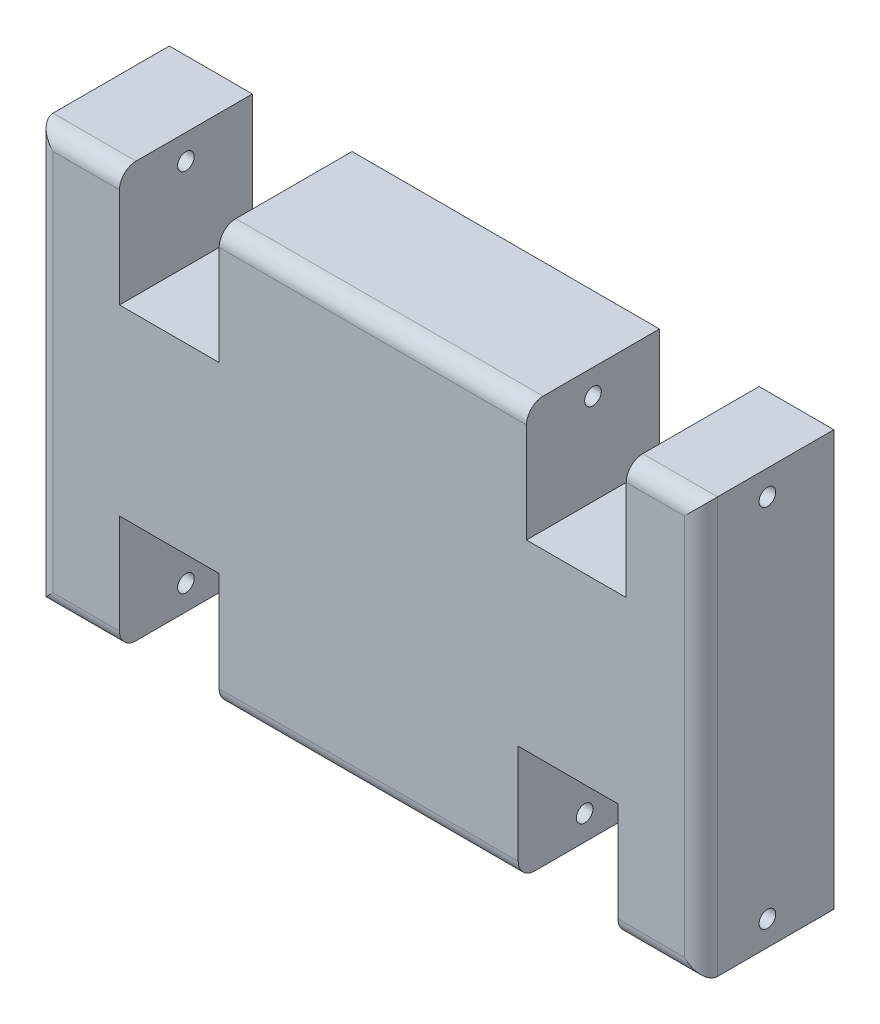
ISO-10303-21;
HEADER;
FILE_DESCRIPTION(('STEP AP214'),'2;1');
FILE_NAME('part.step','',(''),(''),'','','');
FILE_SCHEMA(('AUTOMOTIVE_DESIGN { 1 0 10303 214 1 1 1 1 }'));
ENDSEC;
DATA;
#1=APPLICATION_CONTEXT('core data for automotive mechanical design processes');
#2=APPLICATION_PROTOCOL_DEFINITION('international standard','automotive_design',2000,#1);
#3=PRODUCT_CONTEXT('',#1,'mechanical');
#4=PRODUCT('Part','Part','',(#3));
#5=PRODUCT_RELATED_PRODUCT_CATEGORY('part','',(#4));
#6=PRODUCT_DEFINITION_FORMATION('','',#4);
#7=PRODUCT_DEFINITION_CONTEXT('part definition',#1,'design');
#8=PRODUCT_DEFINITION('design','',#6,#7);
#9=PRODUCT_DEFINITION_SHAPE('','',#8);
#10=(LENGTH_UNIT() NAMED_UNIT(*) SI_UNIT(.MILLI.,.METRE.));
#11=(NAMED_UNIT(*) PLANE_ANGLE_UNIT() SI_UNIT($,.RADIAN.));
#12=(NAMED_UNIT(*) SI_UNIT($,.STERADIAN.) SOLID_ANGLE_UNIT());
#13=UNCERTAINTY_MEASURE_WITH_UNIT(LENGTH_MEASURE(1.E-05),#10,'distance_accuracy_value','');
#14=(GEOMETRIC_REPRESENTATION_CONTEXT(3) GLOBAL_UNCERTAINTY_ASSIGNED_CONTEXT((#13)) GLOBAL_UNIT_ASSIGNED_CONTEXT((#10,
#11,#12)) REPRESENTATION_CONTEXT('',''));
#15=CARTESIAN_POINT('',(0.,0.,0.));
#16=DIRECTION('',(0.,0.,1.));
#17=DIRECTION('',(1.,0.,0.));
#18=AXIS2_PLACEMENT_3D('',#15,#16,#17);
#19=CARTESIAN_POINT('',(1.,0.,7.));
#20=DIRECTION('',(0.,1.,0.));
#21=DIRECTION('',(-1.,0.,0.));
#22=AXIS2_PLACEMENT_3D('',#19,#20,#21);
#23=CYLINDRICAL_SURFACE('',#22,1.);
#24=CARTESIAN_POINT('',(1.,1.,7.));
#25=DIRECTION('',(-0.707106781186547,0.707106781186547,0.));
#26=DIRECTION('',(-0.707106781186547,-0.707106781186547,0.));
#27=AXIS2_PLACEMENT_3D('',#24,#25,#26);
#28=ELLIPSE('',#27,1.41421356237309,1.);
#29=CARTESIAN_POINT('',(1.,1.,8.));
#30=VERTEX_POINT('',#29);
#31=CARTESIAN_POINT('',(0.,0.,7.));
#32=VERTEX_POINT('',#31);
#33=EDGE_CURVE('E11',#30,#32,#28,.F.);
#34=ORIENTED_EDGE('',*,*,#33,.F.);
#35=DIRECTION('',(0.,-1.,0.));
#36=VECTOR('',#35,1.);
#37=CARTESIAN_POINT('',(1.,0.,8.));
#38=LINE('',#37,#36);
#39=CARTESIAN_POINT('',(0.999999999999999,24.,8.));
#40=VERTEX_POINT('',#39);
#41=EDGE_CURVE('E480',#40,#30,#38,.T.);
#42=ORIENTED_EDGE('',*,*,#41,.F.);
#43=CARTESIAN_POINT('',(0.999999999999999,24.,7.));
#44=DIRECTION('',(0.707106781186547,0.707106781186547,0.));
#45=DIRECTION('',(-0.707106781186547,0.707106781186547,0.));
#46=AXIS2_PLACEMENT_3D('',#43,#44,#45);
#47=ELLIPSE('',#46,1.41421356237309,1.);
#48=CARTESIAN_POINT('',(0.,25.,7.));
#49=VERTEX_POINT('',#48);
#50=EDGE_CURVE('E48',#40,#49,#47,.F.);
#51=ORIENTED_EDGE('',*,*,#50,.T.);
#52=DIRECTION('',(0.,-1.,0.));
#53=VECTOR('',#52,1.);
#54=CARTESIAN_POINT('',(0.,0.,7.));
#55=LINE('',#54,#53);
#56=EDGE_CURVE('E494',#32,#49,#55,.F.);
#57=ORIENTED_EDGE('',*,*,#56,.F.);
#58=EDGE_LOOP('',(#34,#42,#51,#57));
#59=FACE_BOUND('',#58,.T.);
#60=ADVANCED_FACE('F39',(#59),#23,.T.);
#61=CARTESIAN_POINT('',(0.,24.,7.));
#62=DIRECTION('',(1.,0.,0.));
#63=DIRECTION('',(0.,0.,-1.));
#64=AXIS2_PLACEMENT_3D('',#61,#62,#63);
#65=CYLINDRICAL_SURFACE('',#64,1.);
#66=ORIENTED_EDGE('',*,*,#50,.F.);
#67=DIRECTION('',(-1.,0.,0.));
#68=VECTOR('',#67,1.);
#69=CARTESIAN_POINT('',(0.,24.,8.));
#70=LINE('',#69,#68);
#71=CARTESIAN_POINT('',(5.,24.,8.));
#72=VERTEX_POINT('',#71);
#73=EDGE_CURVE('E483',#72,#40,#70,.T.);
#74=ORIENTED_EDGE('',*,*,#73,.F.);
#75=CARTESIAN_POINT('',(5.,24.,7.));
#76=DIRECTION('',(-1.,0.,0.));
#77=DIRECTION('',(0.,0.,1.));
#78=AXIS2_PLACEMENT_3D('',#75,#76,#77);
#79=CIRCLE('',#78,1.);
#80=CARTESIAN_POINT('',(5.,25.,7.));
#81=VERTEX_POINT('',#80);
#82=EDGE_CURVE('E491',#81,#72,#79,.F.);
#83=ORIENTED_EDGE('',*,*,#82,.F.);
#84=DIRECTION('',(-1.,0.,0.));
#85=VECTOR('',#84,1.);
#86=CARTESIAN_POINT('',(0.,25.,7.));
#87=LINE('',#86,#85);
#88=EDGE_CURVE('E487',#49,#81,#87,.F.);
#89=ORIENTED_EDGE('',*,*,#88,.F.);
#90=EDGE_LOOP('',(#66,#74,#83,#89));
#91=FACE_BOUND('',#90,.T.);
#92=ADVANCED_FACE('F514',(#91),#65,.T.);
#93=CARTESIAN_POINT('',(0.,1.,7.));
#94=DIRECTION('',(-1.,0.,0.));
#95=DIRECTION('',(0.,0.,1.));
#96=AXIS2_PLACEMENT_3D('',#93,#94,#95);
#97=CYLINDRICAL_SURFACE('',#96,1.);
#98=DIRECTION('',(1.,0.,0.));
#99=VECTOR('',#98,1.);
#100=CARTESIAN_POINT('',(0.,1.,8.));
#101=LINE('',#100,#99);
#102=CARTESIAN_POINT('',(5.,1.,8.));
#103=VERTEX_POINT('',#102);
#104=EDGE_CURVE('E219',#30,#103,#101,.T.);
#105=ORIENTED_EDGE('',*,*,#104,.F.);
#106=ORIENTED_EDGE('',*,*,#33,.T.);
#107=DIRECTION('',(1.,0.,0.));
#108=VECTOR('',#107,1.);
#109=CARTESIAN_POINT('',(0.,0.,7.));
#110=LINE('',#109,#108);
#111=CARTESIAN_POINT('',(5.,0.,7.));
#112=VERTEX_POINT('',#111);
#113=EDGE_CURVE('E498',#112,#32,#110,.F.);
#114=ORIENTED_EDGE('',*,*,#113,.F.);
#115=CARTESIAN_POINT('',(5.,1.,7.));
#116=DIRECTION('',(-1.,0.,0.));
#117=DIRECTION('',(0.,0.,1.));
#118=AXIS2_PLACEMENT_3D('',#115,#116,#117);
#119=CIRCLE('',#118,1.);
#120=EDGE_CURVE('E55',#103,#112,#119,.F.);
#121=ORIENTED_EDGE('',*,*,#120,.F.);
#122=EDGE_LOOP('',(#105,#106,#114,#121));
#123=FACE_BOUND('',#122,.T.);
#124=ADVANCED_FACE('F41',(#123),#97,.T.);
#125=CARTESIAN_POINT('',(0.,24.,7.));
#126=DIRECTION('',(1.,0.,0.));
#127=DIRECTION('',(0.,0.,-1.));
#128=AXIS2_PLACEMENT_3D('',#125,#126,#127);
#129=CYLINDRICAL_SURFACE('',#128,1.);
#130=DIRECTION('',(-1.,0.,0.));
#131=VECTOR('',#130,1.);
#132=CARTESIAN_POINT('',(0.,24.,8.));
#133=LINE('',#132,#131);
#134=CARTESIAN_POINT('',(29.5,24.,8.));
#135=VERTEX_POINT('',#134);
#136=CARTESIAN_POINT('',(11.,24.,8.));
#137=VERTEX_POINT('',#136);
#138=EDGE_CURVE('E463',#135,#137,#133,.T.);
#139=ORIENTED_EDGE('',*,*,#138,.F.);
#140=CARTESIAN_POINT('',(29.5,24.,7.));
#141=DIRECTION('',(-1.,0.,0.));
#142=DIRECTION('',(0.,0.,1.));
#143=AXIS2_PLACEMENT_3D('',#140,#141,#142);
#144=CIRCLE('',#143,1.);
#145=CARTESIAN_POINT('',(29.5,25.,7.));
#146=VERTEX_POINT('',#145);
#147=EDGE_CURVE('E475',#146,#135,#144,.F.);
#148=ORIENTED_EDGE('',*,*,#147,.F.);
#149=DIRECTION('',(-1.,0.,0.));
#150=VECTOR('',#149,1.);
#151=CARTESIAN_POINT('',(0.,25.,7.));
#152=LINE('',#151,#150);
#153=CARTESIAN_POINT('',(11.,25.,7.));
#154=VERTEX_POINT('',#153);
#155=EDGE_CURVE('E471',#154,#146,#152,.F.);
#156=ORIENTED_EDGE('',*,*,#155,.F.);
#157=CARTESIAN_POINT('',(11.,24.,7.));
#158=DIRECTION('',(1.,0.,0.));
#159=DIRECTION('',(0.,0.,-1.));
#160=AXIS2_PLACEMENT_3D('',#157,#158,#159);
#161=CIRCLE('',#160,1.);
#162=EDGE_CURVE('E467',#137,#154,#161,.F.);
#163=ORIENTED_EDGE('',*,*,#162,.F.);
#164=EDGE_LOOP('',(#139,#148,#156,#163));
#165=FACE_BOUND('',#164,.T.);
#166=ADVANCED_FACE('F528',(#165),#129,.T.);
#167=CARTESIAN_POINT('',(39.,0.,7.));
#168=DIRECTION('',(0.,-1.,0.));
#169=DIRECTION('',(1.,0.,0.));
#170=AXIS2_PLACEMENT_3D('',#167,#168,#169);
#171=CYLINDRICAL_SURFACE('',#170,1.);
#172=CARTESIAN_POINT('',(39.,24.,7.));
#173=DIRECTION('',(0.707106781186548,-0.707106781186547,0.));
#174=DIRECTION('',(0.707106781186547,0.707106781186548,0.));
#175=AXIS2_PLACEMENT_3D('',#172,#173,#174);
#176=ELLIPSE('',#175,1.41421356237309,1.);
#177=CARTESIAN_POINT('',(39.,24.,8.));
#178=VERTEX_POINT('',#177);
#179=CARTESIAN_POINT('',(40.,25.,7.));
#180=VERTEX_POINT('',#179);
#181=EDGE_CURVE('E460',#178,#180,#176,.F.);
#182=ORIENTED_EDGE('',*,*,#181,.F.);
#183=DIRECTION('',(0.,1.,0.));
#184=VECTOR('',#183,1.);
#185=CARTESIAN_POINT('',(39.,0.,8.));
#186=LINE('',#185,#184);
#187=CARTESIAN_POINT('',(39.,1.,8.));
#188=VERTEX_POINT('',#187);
#189=EDGE_CURVE('E430',#188,#178,#186,.T.);
#190=ORIENTED_EDGE('',*,*,#189,.F.);
#191=CARTESIAN_POINT('',(39.,1.,7.));
#192=DIRECTION('',(-0.707106781186547,-0.707106781186548,0.));
#193=DIRECTION('',(0.707106781186548,-0.707106781186547,0.));
#194=AXIS2_PLACEMENT_3D('',#191,#192,#193);
#195=ELLIPSE('',#194,1.4142135623731,1.);
#196=CARTESIAN_POINT('',(40.,0.,7.));
#197=VERTEX_POINT('',#196);
#198=EDGE_CURVE('E457',#188,#197,#195,.F.);
#199=ORIENTED_EDGE('',*,*,#198,.T.);
#200=DIRECTION('',(0.,1.,0.));
#201=VECTOR('',#200,1.);
#202=CARTESIAN_POINT('',(40.,0.,7.));
#203=LINE('',#202,#201);
#204=EDGE_CURVE('E445',#180,#197,#203,.F.);
#205=ORIENTED_EDGE('',*,*,#204,.F.);
#206=EDGE_LOOP('',(#182,#190,#199,#205));
#207=FACE_BOUND('',#206,.T.);
#208=ADVANCED_FACE('F533',(#207),#171,.T.);
#209=CARTESIAN_POINT('',(0.,1.,7.));
#210=DIRECTION('',(-1.,0.,0.));
#211=DIRECTION('',(0.,0.,1.));
#212=AXIS2_PLACEMENT_3D('',#209,#210,#211);
#213=CYLINDRICAL_SURFACE('',#212,1.);
#214=ORIENTED_EDGE('',*,*,#198,.F.);
#215=DIRECTION('',(1.,0.,0.));
#216=VECTOR('',#215,1.);
#217=CARTESIAN_POINT('',(0.,1.,8.));
#218=LINE('',#217,#216);
#219=CARTESIAN_POINT('',(35.,1.,8.));
#220=VERTEX_POINT('',#219);
#221=EDGE_CURVE('E434',#220,#188,#218,.T.);
#222=ORIENTED_EDGE('',*,*,#221,.F.);
#223=CARTESIAN_POINT('',(35.,1.,7.));
#224=DIRECTION('',(1.,0.,0.));
#225=DIRECTION('',(0.,0.,-1.));
#226=AXIS2_PLACEMENT_3D('',#223,#224,#225);
#227=CIRCLE('',#226,1.);
#228=CARTESIAN_POINT('',(35.,0.,7.));
#229=VERTEX_POINT('',#228);
#230=EDGE_CURVE('E442',#229,#220,#227,.F.);
#231=ORIENTED_EDGE('',*,*,#230,.F.);
#232=DIRECTION('',(1.,0.,0.));
#233=VECTOR('',#232,1.);
#234=CARTESIAN_POINT('',(0.,0.,7.));
#235=LINE('',#234,#233);
#236=EDGE_CURVE('E438',#197,#229,#235,.F.);
#237=ORIENTED_EDGE('',*,*,#236,.F.);
#238=EDGE_LOOP('',(#214,#222,#231,#237));
#239=FACE_BOUND('',#238,.T.);
#240=ADVANCED_FACE('F545',(#239),#213,.T.);
#241=CARTESIAN_POINT('',(0.,24.,7.));
#242=DIRECTION('',(1.,0.,0.));
#243=DIRECTION('',(0.,0.,-1.));
#244=AXIS2_PLACEMENT_3D('',#241,#242,#243);
#245=CYLINDRICAL_SURFACE('',#244,1.);
#246=DIRECTION('',(-1.,0.,0.));
#247=VECTOR('',#246,1.);
#248=CARTESIAN_POINT('',(0.,24.,8.));
#249=LINE('',#248,#247);
#250=CARTESIAN_POINT('',(35.5,24.,8.));
#251=VERTEX_POINT('',#250);
#252=EDGE_CURVE('E426',#178,#251,#249,.T.);
#253=ORIENTED_EDGE('',*,*,#252,.F.);
#254=ORIENTED_EDGE('',*,*,#181,.T.);
#255=DIRECTION('',(-1.,0.,0.));
#256=VECTOR('',#255,1.);
#257=CARTESIAN_POINT('',(0.,25.,7.));
#258=LINE('',#257,#256);
#259=CARTESIAN_POINT('',(35.5,25.,7.));
#260=VERTEX_POINT('',#259);
#261=EDGE_CURVE('E453',#260,#180,#258,.F.);
#262=ORIENTED_EDGE('',*,*,#261,.F.);
#263=CARTESIAN_POINT('',(35.5,24.,7.));
#264=DIRECTION('',(1.,0.,0.));
#265=DIRECTION('',(0.,0.,-1.));
#266=AXIS2_PLACEMENT_3D('',#263,#264,#265);
#267=CIRCLE('',#266,1.);
#268=EDGE_CURVE('E449',#251,#260,#267,.F.);
#269=ORIENTED_EDGE('',*,*,#268,.F.);
#270=EDGE_LOOP('',(#253,#254,#262,#269));
#271=FACE_BOUND('',#270,.T.);
#272=ADVANCED_FACE('F541',(#271),#245,.T.);
#273=CARTESIAN_POINT('',(0.,1.,7.));
#274=DIRECTION('',(-1.,0.,0.));
#275=DIRECTION('',(0.,0.,1.));
#276=AXIS2_PLACEMENT_3D('',#273,#274,#275);
#277=CYLINDRICAL_SURFACE('',#276,1.);
#278=DIRECTION('',(1.,0.,0.));
#279=VECTOR('',#278,1.);
#280=CARTESIAN_POINT('',(0.,1.,8.));
#281=LINE('',#280,#279);
#282=CARTESIAN_POINT('',(11.,1.,8.));
#283=VERTEX_POINT('',#282);
#284=CARTESIAN_POINT('',(29.,1.,8.));
#285=VERTEX_POINT('',#284);
#286=EDGE_CURVE('E405',#283,#285,#281,.T.);
#287=ORIENTED_EDGE('',*,*,#286,.F.);
#288=CARTESIAN_POINT('',(11.,1.,7.));
#289=DIRECTION('',(1.,0.,0.));
#290=DIRECTION('',(0.,0.,-1.));
#291=AXIS2_PLACEMENT_3D('',#288,#289,#290);
#292=CIRCLE('',#291,1.);
#293=CARTESIAN_POINT('',(11.,0.,7.));
#294=VERTEX_POINT('',#293);
#295=EDGE_CURVE('E423',#294,#283,#292,.F.);
#296=ORIENTED_EDGE('',*,*,#295,.F.);
#297=DIRECTION('',(1.,0.,0.));
#298=VECTOR('',#297,1.);
#299=CARTESIAN_POINT('',(0.,0.,7.));
#300=LINE('',#299,#298);
#301=CARTESIAN_POINT('',(29.,0.,7.));
#302=VERTEX_POINT('',#301);
#303=EDGE_CURVE('E419',#302,#294,#300,.F.);
#304=ORIENTED_EDGE('',*,*,#303,.F.);
#305=CARTESIAN_POINT('',(29.,1.,7.));
#306=DIRECTION('',(-1.,0.,0.));
#307=DIRECTION('',(0.,0.,1.));
#308=AXIS2_PLACEMENT_3D('',#305,#306,#307);
#309=CIRCLE('',#308,1.);
#310=EDGE_CURVE('E415',#285,#302,#309,.F.);
#311=ORIENTED_EDGE('',*,*,#310,.F.);
#312=EDGE_LOOP('',(#287,#296,#304,#311));
#313=FACE_BOUND('',#312,.T.);
#314=ADVANCED_FACE('F544',(#313),#277,.T.);
#315=CARTESIAN_POINT('',(0.,25.,8.));
#316=DIRECTION('',(1.,0.,0.));
#317=DIRECTION('',(0.,1.,0.));
#318=AXIS2_PLACEMENT_3D('',#315,#316,#317);
#319=PLANE('',#318);
#320=CARTESIAN_POINT('',(0.,23.4982475986084,4.));
#321=DIRECTION('',(1.,0.,0.));
#322=DIRECTION('',(0.,1.,0.));
#323=AXIS2_PLACEMENT_3D('',#320,#321,#322);
#324=CIRCLE('',#323,0.5);
#325=CARTESIAN_POINT('',(0.,23.9982475986084,4.));
#326=VERTEX_POINT('',#325);
#327=EDGE_CURVE('E663',#326,#326,#324,.T.);
#328=ORIENTED_EDGE('',*,*,#327,.T.);
#329=EDGE_LOOP('',(#328));
#330=FACE_BOUND('',#329,.T.);
#331=DIRECTION('',(0.,0.,-1.));
#332=VECTOR('',#331,1.);
#333=CARTESIAN_POINT('',(0.,0.,8.));
#334=LINE('',#333,#332);
#335=CARTESIAN_POINT('',(0.,0.,0.));
#336=VERTEX_POINT('',#335);
#337=EDGE_CURVE('E402',#32,#336,#334,.T.);
#338=ORIENTED_EDGE('',*,*,#337,.F.);
#339=ORIENTED_EDGE('',*,*,#56,.T.);
#340=DIRECTION('',(0.,0.,-1.));
#341=VECTOR('',#340,1.);
#342=CARTESIAN_POINT('',(0.,25.,8.));
#343=LINE('',#342,#341);
#344=CARTESIAN_POINT('',(0.,25.,0.));
#345=VERTEX_POINT('',#344);
#346=EDGE_CURVE('E273',#49,#345,#343,.T.);
#347=ORIENTED_EDGE('',*,*,#346,.T.);
#348=DIRECTION('',(0.,-1.,0.));
#349=VECTOR('',#348,1.);
#350=CARTESIAN_POINT('',(0.,25.,0.));
#351=LINE('',#350,#349);
#352=EDGE_CURVE('E274',#345,#336,#351,.T.);
#353=ORIENTED_EDGE('',*,*,#352,.T.);
#354=EDGE_LOOP('',(#338,#339,#347,#353));
#355=FACE_BOUND('',#354,.T.);
#356=CARTESIAN_POINT('',(0.,1.50175240139162,4.));
#357=DIRECTION('',(1.,0.,0.));
#358=DIRECTION('',(0.,1.,0.));
#359=AXIS2_PLACEMENT_3D('',#356,#357,#358);
#360=CIRCLE('',#359,0.5);
#361=CARTESIAN_POINT('',(0.,2.00175240139162,4.));
#362=VERTEX_POINT('',#361);
#363=EDGE_CURVE('E279',#362,#362,#360,.F.);
#364=ORIENTED_EDGE('',*,*,#363,.F.);
#365=EDGE_LOOP('',(#364));
#366=FACE_BOUND('',#365,.T.);
#367=ADVANCED_FACE('F511',(#330,#355,#366),#319,.F.);
#368=CARTESIAN_POINT('',(40.,25.,8.));
#369=DIRECTION('',(-1.,0.,0.));
#370=DIRECTION('',(0.,-1.,0.));
#371=AXIS2_PLACEMENT_3D('',#368,#369,#370);
#372=PLANE('',#371);
#373=CARTESIAN_POINT('',(40.,23.4982475986084,4.));
#374=DIRECTION('',(1.,0.,0.));
#375=DIRECTION('',(0.,0.,-1.));
#376=AXIS2_PLACEMENT_3D('',#373,#374,#375);
#377=CIRCLE('',#376,0.5);
#378=CARTESIAN_POINT('',(40.,23.4982475986084,3.5));
#379=VERTEX_POINT('',#378);
#380=EDGE_CURVE('E740',#379,#379,#377,.T.);
#381=ORIENTED_EDGE('',*,*,#380,.F.);
#382=EDGE_LOOP('',(#381));
#383=FACE_BOUND('',#382,.T.);
#384=DIRECTION('',(0.,0.,-1.));
#385=VECTOR('',#384,1.);
#386=CARTESIAN_POINT('',(40.,25.,8.));
#387=LINE('',#386,#385);
#388=CARTESIAN_POINT('',(40.,25.,0.));
#389=VERTEX_POINT('',#388);
#390=EDGE_CURVE('E375',#180,#389,#387,.T.);
#391=ORIENTED_EDGE('',*,*,#390,.F.);
#392=ORIENTED_EDGE('',*,*,#204,.T.);
#393=DIRECTION('',(0.,0.,-1.));
#394=VECTOR('',#393,1.);
#395=CARTESIAN_POINT('',(40.,0.,8.));
#396=LINE('',#395,#394);
#397=CARTESIAN_POINT('',(40.,0.,0.));
#398=VERTEX_POINT('',#397);
#399=EDGE_CURVE('E378',#197,#398,#396,.T.);
#400=ORIENTED_EDGE('',*,*,#399,.T.);
#401=DIRECTION('',(0.,1.,0.));
#402=VECTOR('',#401,1.);
#403=CARTESIAN_POINT('',(40.,25.,0.));
#404=LINE('',#403,#402);
#405=EDGE_CURVE('E310',#398,#389,#404,.T.);
#406=ORIENTED_EDGE('',*,*,#405,.T.);
#407=EDGE_LOOP('',(#391,#392,#400,#406));
#408=FACE_BOUND('',#407,.T.);
#409=CARTESIAN_POINT('',(40.,1.50175240139162,4.));
#410=DIRECTION('',(-1.,0.,0.));
#411=DIRECTION('',(0.,0.,1.));
#412=AXIS2_PLACEMENT_3D('',#409,#410,#411);
#413=CIRCLE('',#412,0.5);
#414=CARTESIAN_POINT('',(40.,1.50175240139162,4.5));
#415=VERTEX_POINT('',#414);
#416=EDGE_CURVE('E411',#415,#415,#413,.T.);
#417=ORIENTED_EDGE('',*,*,#416,.T.);
#418=EDGE_LOOP('',(#417));
#419=FACE_BOUND('',#418,.T.);
#420=ADVANCED_FACE('F558',(#383,#408,#419),#372,.F.);
#421=CARTESIAN_POINT('',(0.,0.,8.));
#422=DIRECTION('',(0.,1.,0.));
#423=DIRECTION('',(0.,0.,1.));
#424=AXIS2_PLACEMENT_3D('',#421,#422,#423);
#425=PLANE('',#424);
#426=DIRECTION('',(0.,0.,-1.));
#427=VECTOR('',#426,1.);
#428=CARTESIAN_POINT('',(5.,0.,8.));
#429=LINE('',#428,#427);
#430=CARTESIAN_POINT('',(5.,0.,0.));
#431=VERTEX_POINT('',#430);
#432=EDGE_CURVE('E231',#112,#431,#429,.T.);
#433=ORIENTED_EDGE('',*,*,#432,.F.);
#434=ORIENTED_EDGE('',*,*,#113,.T.);
#435=ORIENTED_EDGE('',*,*,#337,.T.);
#436=DIRECTION('',(1.,0.,0.));
#437=VECTOR('',#436,1.);
#438=CARTESIAN_POINT('',(0.,0.,0.));
#439=LINE('',#438,#437);
#440=EDGE_CURVE('E278',#336,#431,#439,.T.);
#441=ORIENTED_EDGE('',*,*,#440,.T.);
#442=EDGE_LOOP('',(#433,#434,#435,#441));
#443=FACE_BOUND('',#442,.T.);
#444=ADVANCED_FACE('F526',(#443),#425,.F.);
#445=CARTESIAN_POINT('',(5.,0.,8.));
#446=DIRECTION('',(-1.,0.,0.));
#447=DIRECTION('',(0.,0.,1.));
#448=AXIS2_PLACEMENT_3D('',#445,#446,#447);
#449=PLANE('',#448);
#450=CARTESIAN_POINT('',(5.,1.50175240139162,4.));
#451=DIRECTION('',(-1.,0.,0.));
#452=DIRECTION('',(0.,0.,1.));
#453=AXIS2_PLACEMENT_3D('',#450,#451,#452);
#454=CIRCLE('',#453,0.5);
#455=CARTESIAN_POINT('',(5.,1.50175240139162,4.5));
#456=VERTEX_POINT('',#455);
#457=EDGE_CURVE('E678',#456,#456,#454,.F.);
#458=ORIENTED_EDGE('',*,*,#457,.F.);
#459=EDGE_LOOP('',(#458));
#460=FACE_BOUND('',#459,.T.);
#461=DIRECTION('',(0.,1.,0.));
#462=VECTOR('',#461,1.);
#463=CARTESIAN_POINT('',(5.,0.,8.));
#464=LINE('',#463,#462);
#465=CARTESIAN_POINT('',(5.,7.,8.));
#466=VERTEX_POINT('',#465);
#467=EDGE_CURVE('E210',#103,#466,#464,.T.);
#468=ORIENTED_EDGE('',*,*,#467,.F.);
#469=ORIENTED_EDGE('',*,*,#120,.T.);
#470=ORIENTED_EDGE('',*,*,#432,.T.);
#471=DIRECTION('',(0.,1.,0.));
#472=VECTOR('',#471,1.);
#473=CARTESIAN_POINT('',(5.,0.,0.));
#474=LINE('',#473,#472);
#475=CARTESIAN_POINT('',(5.,7.,0.));
#476=VERTEX_POINT('',#475);
#477=EDGE_CURVE('E227',#431,#476,#474,.T.);
#478=ORIENTED_EDGE('',*,*,#477,.T.);
#479=DIRECTION('',(0.,0.,-1.));
#480=VECTOR('',#479,1.);
#481=CARTESIAN_POINT('',(5.,7.,8.));
#482=LINE('',#481,#480);
#483=EDGE_CURVE('E224',#466,#476,#482,.T.);
#484=ORIENTED_EDGE('',*,*,#483,.F.);
#485=EDGE_LOOP('',(#468,#469,#470,#478,#484));
#486=FACE_BOUND('',#485,.T.);
#487=ADVANCED_FACE('F225',(#460,#486),#449,.F.);
#488=CARTESIAN_POINT('',(5.,7.,8.));
#489=DIRECTION('',(0.,1.,0.));
#490=DIRECTION('',(0.,0.,1.));
#491=AXIS2_PLACEMENT_3D('',#488,#489,#490);
#492=PLANE('',#491);
#493=DIRECTION('',(1.,0.,0.));
#494=VECTOR('',#493,1.);
#495=CARTESIAN_POINT('',(5.,7.,0.));
#496=LINE('',#495,#494);
#497=CARTESIAN_POINT('',(11.,7.,0.));
#498=VERTEX_POINT('',#497);
#499=EDGE_CURVE('E285',#476,#498,#496,.T.);
#500=ORIENTED_EDGE('',*,*,#499,.T.);
#501=DIRECTION('',(0.,0.,-1.));
#502=VECTOR('',#501,1.);
#503=CARTESIAN_POINT('',(11.,7.,8.));
#504=LINE('',#503,#502);
#505=CARTESIAN_POINT('',(11.,7.,8.));
#506=VERTEX_POINT('',#505);
#507=EDGE_CURVE('E232',#506,#498,#504,.T.);
#508=ORIENTED_EDGE('',*,*,#507,.F.);
#509=DIRECTION('',(1.,0.,0.));
#510=VECTOR('',#509,1.);
#511=CARTESIAN_POINT('',(5.,7.,8.));
#512=LINE('',#511,#510);
#513=EDGE_CURVE('E216',#466,#506,#512,.T.);
#514=ORIENTED_EDGE('',*,*,#513,.F.);
#515=ORIENTED_EDGE('',*,*,#483,.T.);
#516=EDGE_LOOP('',(#500,#508,#514,#515));
#517=FACE_BOUND('',#516,.T.);
#518=ADVANCED_FACE('F234',(#517),#492,.F.);
#519=CARTESIAN_POINT('',(11.,7.,8.));
#520=DIRECTION('',(1.,0.,0.));
#521=DIRECTION('',(0.,0.,-1.));
#522=AXIS2_PLACEMENT_3D('',#519,#520,#521);
#523=PLANE('',#522);
#524=CARTESIAN_POINT('',(11.,1.50175240139162,4.));
#525=DIRECTION('',(1.,0.,0.));
#526=DIRECTION('',(0.,0.,-1.));
#527=AXIS2_PLACEMENT_3D('',#524,#525,#526);
#528=CIRCLE('',#527,0.5);
#529=CARTESIAN_POINT('',(11.,1.50175240139162,3.5));
#530=VERTEX_POINT('',#529);
#531=EDGE_CURVE('E668',#530,#530,#528,.F.);
#532=ORIENTED_EDGE('',*,*,#531,.F.);
#533=EDGE_LOOP('',(#532));
#534=FACE_BOUND('',#533,.T.);
#535=DIRECTION('',(0.,0.,-1.));
#536=VECTOR('',#535,1.);
#537=CARTESIAN_POINT('',(11.,0.,8.));
#538=LINE('',#537,#536);
#539=CARTESIAN_POINT('',(11.,0.,0.));
#540=VERTEX_POINT('',#539);
#541=EDGE_CURVE('E395',#294,#540,#538,.T.);
#542=ORIENTED_EDGE('',*,*,#541,.F.);
#543=ORIENTED_EDGE('',*,*,#295,.T.);
#544=DIRECTION('',(0.,-1.,0.));
#545=VECTOR('',#544,1.);
#546=CARTESIAN_POINT('',(11.,7.,8.));
#547=LINE('',#546,#545);
#548=EDGE_CURVE('E238',#506,#283,#547,.T.);
#549=ORIENTED_EDGE('',*,*,#548,.F.);
#550=ORIENTED_EDGE('',*,*,#507,.T.);
#551=DIRECTION('',(0.,-1.,0.));
#552=VECTOR('',#551,1.);
#553=CARTESIAN_POINT('',(11.,7.,0.));
#554=LINE('',#553,#552);
#555=EDGE_CURVE('E288',#498,#540,#554,.T.);
#556=ORIENTED_EDGE('',*,*,#555,.T.);
#557=EDGE_LOOP('',(#542,#543,#549,#550,#556));
#558=FACE_BOUND('',#557,.T.);
#559=ADVANCED_FACE('F567',(#534,#558),#523,.F.);
#560=CARTESIAN_POINT('',(11.,0.,8.));
#561=DIRECTION('',(0.,1.,0.));
#562=DIRECTION('',(0.,0.,1.));
#563=AXIS2_PLACEMENT_3D('',#560,#561,#562);
#564=PLANE('',#563);
#565=DIRECTION('',(0.,0.,-1.));
#566=VECTOR('',#565,1.);
#567=CARTESIAN_POINT('',(29.,0.,8.));
#568=LINE('',#567,#566);
#569=CARTESIAN_POINT('',(29.,0.,0.));
#570=VERTEX_POINT('',#569);
#571=EDGE_CURVE('E392',#302,#570,#568,.T.);
#572=ORIENTED_EDGE('',*,*,#571,.F.);
#573=ORIENTED_EDGE('',*,*,#303,.T.);
#574=ORIENTED_EDGE('',*,*,#541,.T.);
#575=DIRECTION('',(1.,0.,0.));
#576=VECTOR('',#575,1.);
#577=CARTESIAN_POINT('',(11.,0.,0.));
#578=LINE('',#577,#576);
#579=EDGE_CURVE('E292',#540,#570,#578,.T.);
#580=ORIENTED_EDGE('',*,*,#579,.T.);
#581=EDGE_LOOP('',(#572,#573,#574,#580));
#582=FACE_BOUND('',#581,.T.);
#583=ADVANCED_FACE('F570',(#582),#564,.F.);
#584=CARTESIAN_POINT('',(29.,7.,8.));
#585=DIRECTION('',(-1.,0.,0.));
#586=DIRECTION('',(0.,0.,1.));
#587=AXIS2_PLACEMENT_3D('',#584,#585,#586);
#588=PLANE('',#587);
#589=CARTESIAN_POINT('',(29.,1.50175240139162,4.));
#590=DIRECTION('',(-1.,0.,0.));
#591=DIRECTION('',(0.,0.,1.));
#592=AXIS2_PLACEMENT_3D('',#589,#590,#591);
#593=CIRCLE('',#592,0.5);
#594=CARTESIAN_POINT('',(29.,1.50175240139162,4.5));
#595=VERTEX_POINT('',#594);
#596=EDGE_CURVE('E662',#595,#595,#593,.F.);
#597=ORIENTED_EDGE('',*,*,#596,.F.);
#598=EDGE_LOOP('',(#597));
#599=FACE_BOUND('',#598,.T.);
#600=DIRECTION('',(0.,1.,0.));
#601=VECTOR('',#600,1.);
#602=CARTESIAN_POINT('',(29.,7.,8.));
#603=LINE('',#602,#601);
#604=CARTESIAN_POINT('',(29.,7.,8.));
#605=VERTEX_POINT('',#604);
#606=EDGE_CURVE('E241',#285,#605,#603,.T.);
#607=ORIENTED_EDGE('',*,*,#606,.F.);
#608=ORIENTED_EDGE('',*,*,#310,.T.);
#609=ORIENTED_EDGE('',*,*,#571,.T.);
#610=DIRECTION('',(0.,1.,0.));
#611=VECTOR('',#610,1.);
#612=CARTESIAN_POINT('',(29.,7.,0.));
#613=LINE('',#612,#611);
#614=CARTESIAN_POINT('',(29.,7.,0.));
#615=VERTEX_POINT('',#614);
#616=EDGE_CURVE('E296',#570,#615,#613,.T.);
#617=ORIENTED_EDGE('',*,*,#616,.T.);
#618=DIRECTION('',(0.,0.,-1.));
#619=VECTOR('',#618,1.);
#620=CARTESIAN_POINT('',(29.,7.,8.));
#621=LINE('',#620,#619);
#622=EDGE_CURVE('E388',#605,#615,#621,.T.);
#623=ORIENTED_EDGE('',*,*,#622,.F.);
#624=EDGE_LOOP('',(#607,#608,#609,#617,#623));
#625=FACE_BOUND('',#624,.T.);
#626=ADVANCED_FACE('F574',(#599,#625),#588,.F.);
#627=CARTESIAN_POINT('',(29.,7.,8.));
#628=DIRECTION('',(0.,1.,0.));
#629=DIRECTION('',(-1.,0.,0.));
#630=AXIS2_PLACEMENT_3D('',#627,#628,#629);
#631=PLANE('',#630);
#632=DIRECTION('',(1.,0.,0.));
#633=VECTOR('',#632,1.);
#634=CARTESIAN_POINT('',(29.,7.,0.));
#635=LINE('',#634,#633);
#636=CARTESIAN_POINT('',(35.,7.,0.));
#637=VERTEX_POINT('',#636);
#638=EDGE_CURVE('E299',#615,#637,#635,.T.);
#639=ORIENTED_EDGE('',*,*,#638,.T.);
#640=DIRECTION('',(0.,0.,-1.));
#641=VECTOR('',#640,1.);
#642=CARTESIAN_POINT('',(35.,7.,8.));
#643=LINE('',#642,#641);
#644=CARTESIAN_POINT('',(35.,7.,8.));
#645=VERTEX_POINT('',#644);
#646=EDGE_CURVE('E384',#645,#637,#643,.T.);
#647=ORIENTED_EDGE('',*,*,#646,.F.);
#648=DIRECTION('',(1.,0.,0.));
#649=VECTOR('',#648,1.);
#650=CARTESIAN_POINT('',(29.,7.,8.));
#651=LINE('',#650,#649);
#652=EDGE_CURVE('E247',#605,#645,#651,.T.);
#653=ORIENTED_EDGE('',*,*,#652,.F.);
#654=ORIENTED_EDGE('',*,*,#622,.T.);
#655=EDGE_LOOP('',(#639,#647,#653,#654));
#656=FACE_BOUND('',#655,.T.);
#657=ADVANCED_FACE('F578',(#656),#631,.F.);
#658=CARTESIAN_POINT('',(35.,7.,8.));
#659=DIRECTION('',(1.,0.,0.));
#660=DIRECTION('',(0.,0.,-1.));
#661=AXIS2_PLACEMENT_3D('',#658,#659,#660);
#662=PLANE('',#661);
#663=CARTESIAN_POINT('',(35.,1.50175240139162,4.));
#664=DIRECTION('',(1.,0.,0.));
#665=DIRECTION('',(0.,0.,-1.));
#666=AXIS2_PLACEMENT_3D('',#663,#664,#665);
#667=CIRCLE('',#666,0.5);
#668=CARTESIAN_POINT('',(35.,1.50175240139162,3.5));
#669=VERTEX_POINT('',#668);
#670=EDGE_CURVE('E660',#669,#669,#667,.F.);
#671=ORIENTED_EDGE('',*,*,#670,.F.);
#672=EDGE_LOOP('',(#671));
#673=FACE_BOUND('',#672,.T.);
#674=DIRECTION('',(0.,0.,-1.));
#675=VECTOR('',#674,1.);
#676=CARTESIAN_POINT('',(35.,0.,8.));
#677=LINE('',#676,#675);
#678=CARTESIAN_POINT('',(35.,0.,0.));
#679=VERTEX_POINT('',#678);
#680=EDGE_CURVE('E381',#229,#679,#677,.T.);
#681=ORIENTED_EDGE('',*,*,#680,.F.);
#682=ORIENTED_EDGE('',*,*,#230,.T.);
#683=DIRECTION('',(0.,-1.,0.));
#684=VECTOR('',#683,1.);
#685=CARTESIAN_POINT('',(35.,7.,8.));
#686=LINE('',#685,#684);
#687=EDGE_CURVE('E250',#645,#220,#686,.T.);
#688=ORIENTED_EDGE('',*,*,#687,.F.);
#689=ORIENTED_EDGE('',*,*,#646,.T.);
#690=DIRECTION('',(0.,-1.,0.));
#691=VECTOR('',#690,1.);
#692=CARTESIAN_POINT('',(35.,7.,0.));
#693=LINE('',#692,#691);
#694=EDGE_CURVE('E302',#637,#679,#693,.T.);
#695=ORIENTED_EDGE('',*,*,#694,.T.);
#696=EDGE_LOOP('',(#681,#682,#688,#689,#695));
#697=FACE_BOUND('',#696,.T.);
#698=ADVANCED_FACE('F582',(#673,#697),#662,.F.);
#699=CARTESIAN_POINT('',(35.,0.,8.));
#700=DIRECTION('',(0.,1.,0.));
#701=DIRECTION('',(0.,0.,1.));
#702=AXIS2_PLACEMENT_3D('',#699,#700,#701);
#703=PLANE('',#702);
#704=ORIENTED_EDGE('',*,*,#399,.F.);
#705=ORIENTED_EDGE('',*,*,#236,.T.);
#706=ORIENTED_EDGE('',*,*,#680,.T.);
#707=DIRECTION('',(1.,0.,0.));
#708=VECTOR('',#707,1.);
#709=CARTESIAN_POINT('',(35.,0.,0.));
#710=LINE('',#709,#708);
#711=EDGE_CURVE('E306',#679,#398,#710,.T.);
#712=ORIENTED_EDGE('',*,*,#711,.T.);
#713=EDGE_LOOP('',(#704,#705,#706,#712));
#714=FACE_BOUND('',#713,.T.);
#715=ADVANCED_FACE('F586',(#714),#703,.F.);
#716=CARTESIAN_POINT('',(35.5,25.,8.));
#717=DIRECTION('',(0.,-1.,0.));
#718=DIRECTION('',(0.,0.,-1.));
#719=AXIS2_PLACEMENT_3D('',#716,#717,#718);
#720=PLANE('',#719);
#721=DIRECTION('',(0.,0.,-1.));
#722=VECTOR('',#721,1.);
#723=CARTESIAN_POINT('',(35.5,25.,8.));
#724=LINE('',#723,#722);
#725=CARTESIAN_POINT('',(35.5,25.,0.));
#726=VERTEX_POINT('',#725);
#727=EDGE_CURVE('E372',#260,#726,#724,.T.);
#728=ORIENTED_EDGE('',*,*,#727,.F.);
#729=ORIENTED_EDGE('',*,*,#261,.T.);
#730=ORIENTED_EDGE('',*,*,#390,.T.);
#731=DIRECTION('',(-1.,0.,0.));
#732=VECTOR('',#731,1.);
#733=CARTESIAN_POINT('',(35.5,25.,0.));
#734=LINE('',#733,#732);
#735=EDGE_CURVE('E314',#389,#726,#734,.T.);
#736=ORIENTED_EDGE('',*,*,#735,.T.);
#737=EDGE_LOOP('',(#728,#729,#730,#736));
#738=FACE_BOUND('',#737,.T.);
#739=ADVANCED_FACE('F590',(#738),#720,.F.);
#740=CARTESIAN_POINT('',(35.5,18.,8.));
#741=DIRECTION('',(1.,0.,0.));
#742=DIRECTION('',(0.,0.,-1.));
#743=AXIS2_PLACEMENT_3D('',#740,#741,#742);
#744=PLANE('',#743);
#745=CARTESIAN_POINT('',(35.5,23.4982475986084,4.));
#746=DIRECTION('',(1.,0.,0.));
#747=DIRECTION('',(0.,0.,-1.));
#748=AXIS2_PLACEMENT_3D('',#745,#746,#747);
#749=CIRCLE('',#748,0.5);
#750=CARTESIAN_POINT('',(35.5,23.4982475986084,3.5));
#751=VERTEX_POINT('',#750);
#752=EDGE_CURVE('E671',#751,#751,#749,.T.);
#753=ORIENTED_EDGE('',*,*,#752,.T.);
#754=EDGE_LOOP('',(#753));
#755=FACE_BOUND('',#754,.T.);
#756=DIRECTION('',(0.,-1.,0.));
#757=VECTOR('',#756,1.);
#758=CARTESIAN_POINT('',(35.5,18.,8.));
#759=LINE('',#758,#757);
#760=CARTESIAN_POINT('',(35.5,18.,8.));
#761=VERTEX_POINT('',#760);
#762=EDGE_CURVE('E254',#251,#761,#759,.T.);
#763=ORIENTED_EDGE('',*,*,#762,.F.);
#764=ORIENTED_EDGE('',*,*,#268,.T.);
#765=ORIENTED_EDGE('',*,*,#727,.T.);
#766=DIRECTION('',(0.,-1.,0.));
#767=VECTOR('',#766,1.);
#768=CARTESIAN_POINT('',(35.5,18.,0.));
#769=LINE('',#768,#767);
#770=CARTESIAN_POINT('',(35.5,18.,0.));
#771=VERTEX_POINT('',#770);
#772=EDGE_CURVE('E318',#726,#771,#769,.T.);
#773=ORIENTED_EDGE('',*,*,#772,.T.);
#774=DIRECTION('',(0.,0.,-1.));
#775=VECTOR('',#774,1.);
#776=CARTESIAN_POINT('',(35.5,18.,8.));
#777=LINE('',#776,#775);
#778=EDGE_CURVE('E368',#761,#771,#777,.T.);
#779=ORIENTED_EDGE('',*,*,#778,.F.);
#780=EDGE_LOOP('',(#763,#764,#765,#773,#779));
#781=FACE_BOUND('',#780,.T.);
#782=ADVANCED_FACE('F597',(#755,#781),#744,.F.);
#783=CARTESIAN_POINT('',(29.5,18.,8.));
#784=DIRECTION('',(0.,-1.,0.));
#785=DIRECTION('',(0.,0.,-1.));
#786=AXIS2_PLACEMENT_3D('',#783,#784,#785);
#787=PLANE('',#786);
#788=DIRECTION('',(-1.,0.,0.));
#789=VECTOR('',#788,1.);
#790=CARTESIAN_POINT('',(29.5,18.,0.));
#791=LINE('',#790,#789);
#792=CARTESIAN_POINT('',(29.5,18.,0.));
#793=VERTEX_POINT('',#792);
#794=EDGE_CURVE('E321',#771,#793,#791,.T.);
#795=ORIENTED_EDGE('',*,*,#794,.T.);
#796=DIRECTION('',(0.,0.,-1.));
#797=VECTOR('',#796,1.);
#798=CARTESIAN_POINT('',(29.5,18.,8.));
#799=LINE('',#798,#797);
#800=CARTESIAN_POINT('',(29.5,18.,8.));
#801=VERTEX_POINT('',#800);
#802=EDGE_CURVE('E364',#801,#793,#799,.T.);
#803=ORIENTED_EDGE('',*,*,#802,.F.);
#804=DIRECTION('',(-1.,0.,0.));
#805=VECTOR('',#804,1.);
#806=CARTESIAN_POINT('',(29.5,18.,8.));
#807=LINE('',#806,#805);
#808=EDGE_CURVE('E257',#761,#801,#807,.T.);
#809=ORIENTED_EDGE('',*,*,#808,.F.);
#810=ORIENTED_EDGE('',*,*,#778,.T.);
#811=EDGE_LOOP('',(#795,#803,#809,#810));
#812=FACE_BOUND('',#811,.T.);
#813=ADVANCED_FACE('F601',(#812),#787,.F.);
#814=CARTESIAN_POINT('',(29.5,18.,8.));
#815=DIRECTION('',(-1.,0.,0.));
#816=DIRECTION('',(0.,0.,1.));
#817=AXIS2_PLACEMENT_3D('',#814,#815,#816);
#818=PLANE('',#817);
#819=CARTESIAN_POINT('',(29.5,23.4982475986084,4.));
#820=DIRECTION('',(-1.,0.,0.));
#821=DIRECTION('',(0.,0.,1.));
#822=AXIS2_PLACEMENT_3D('',#819,#820,#821);
#823=CIRCLE('',#822,0.5);
#824=CARTESIAN_POINT('',(29.5,23.4982475986084,4.5));
#825=VERTEX_POINT('',#824);
#826=EDGE_CURVE('E749',#825,#825,#823,.T.);
#827=ORIENTED_EDGE('',*,*,#826,.T.);
#828=EDGE_LOOP('',(#827));
#829=FACE_BOUND('',#828,.T.);
#830=DIRECTION('',(0.,0.,-1.));
#831=VECTOR('',#830,1.);
#832=CARTESIAN_POINT('',(29.5,25.,8.));
#833=LINE('',#832,#831);
#834=CARTESIAN_POINT('',(29.5,25.,0.));
#835=VERTEX_POINT('',#834);
#836=EDGE_CURVE('E361',#146,#835,#833,.T.);
#837=ORIENTED_EDGE('',*,*,#836,.F.);
#838=ORIENTED_EDGE('',*,*,#147,.T.);
#839=DIRECTION('',(0.,1.,0.));
#840=VECTOR('',#839,1.);
#841=CARTESIAN_POINT('',(29.5,18.,8.));
#842=LINE('',#841,#840);
#843=EDGE_CURVE('E260',#801,#135,#842,.T.);
#844=ORIENTED_EDGE('',*,*,#843,.F.);
#845=ORIENTED_EDGE('',*,*,#802,.T.);
#846=DIRECTION('',(0.,1.,0.));
#847=VECTOR('',#846,1.);
#848=CARTESIAN_POINT('',(29.5,18.,0.));
#849=LINE('',#848,#847);
#850=EDGE_CURVE('E324',#793,#835,#849,.T.);
#851=ORIENTED_EDGE('',*,*,#850,.T.);
#852=EDGE_LOOP('',(#837,#838,#844,#845,#851));
#853=FACE_BOUND('',#852,.T.);
#854=ADVANCED_FACE('F605',(#829,#853),#818,.F.);
#855=CARTESIAN_POINT('',(11.,25.,8.));
#856=DIRECTION('',(0.,-1.,0.));
#857=DIRECTION('',(0.,0.,-1.));
#858=AXIS2_PLACEMENT_3D('',#855,#856,#857);
#859=PLANE('',#858);
#860=DIRECTION('',(0.,0.,-1.));
#861=VECTOR('',#860,1.);
#862=CARTESIAN_POINT('',(11.,25.,8.));
#863=LINE('',#862,#861);
#864=CARTESIAN_POINT('',(11.,25.,0.));
#865=VERTEX_POINT('',#864);
#866=EDGE_CURVE('E358',#154,#865,#863,.T.);
#867=ORIENTED_EDGE('',*,*,#866,.F.);
#868=ORIENTED_EDGE('',*,*,#155,.T.);
#869=ORIENTED_EDGE('',*,*,#836,.T.);
#870=DIRECTION('',(-1.,0.,0.));
#871=VECTOR('',#870,1.);
#872=CARTESIAN_POINT('',(11.,25.,0.));
#873=LINE('',#872,#871);
#874=EDGE_CURVE('E328',#835,#865,#873,.T.);
#875=ORIENTED_EDGE('',*,*,#874,.T.);
#876=EDGE_LOOP('',(#867,#868,#869,#875));
#877=FACE_BOUND('',#876,.T.);
#878=ADVANCED_FACE('F609',(#877),#859,.F.);
#879=CARTESIAN_POINT('',(11.,18.,8.));
#880=DIRECTION('',(1.,0.,0.));
#881=DIRECTION('',(0.,0.,-1.));
#882=AXIS2_PLACEMENT_3D('',#879,#880,#881);
#883=PLANE('',#882);
#884=CARTESIAN_POINT('',(11.,23.4982475986084,4.));
#885=DIRECTION('',(1.,0.,0.));
#886=DIRECTION('',(0.,0.,-1.));
#887=AXIS2_PLACEMENT_3D('',#884,#885,#886);
#888=CIRCLE('',#887,0.5);
#889=CARTESIAN_POINT('',(11.,23.4982475986084,3.5));
#890=VERTEX_POINT('',#889);
#891=EDGE_CURVE('E410',#890,#890,#888,.T.);
#892=ORIENTED_EDGE('',*,*,#891,.T.);
#893=EDGE_LOOP('',(#892));
#894=FACE_BOUND('',#893,.T.);
#895=DIRECTION('',(0.,-1.,0.));
#896=VECTOR('',#895,1.);
#897=CARTESIAN_POINT('',(11.,18.,8.));
#898=LINE('',#897,#896);
#899=CARTESIAN_POINT('',(11.,18.,8.));
#900=VERTEX_POINT('',#899);
#901=EDGE_CURVE('E264',#137,#900,#898,.T.);
#902=ORIENTED_EDGE('',*,*,#901,.F.);
#903=ORIENTED_EDGE('',*,*,#162,.T.);
#904=ORIENTED_EDGE('',*,*,#866,.T.);
#905=DIRECTION('',(0.,-1.,0.));
#906=VECTOR('',#905,1.);
#907=CARTESIAN_POINT('',(11.,18.,0.));
#908=LINE('',#907,#906);
#909=CARTESIAN_POINT('',(11.,18.,0.));
#910=VERTEX_POINT('',#909);
#911=EDGE_CURVE('E332',#865,#910,#908,.T.);
#912=ORIENTED_EDGE('',*,*,#911,.T.);
#913=DIRECTION('',(0.,0.,-1.));
#914=VECTOR('',#913,1.);
#915=CARTESIAN_POINT('',(11.,18.,8.));
#916=LINE('',#915,#914);
#917=EDGE_CURVE('E354',#900,#910,#916,.T.);
#918=ORIENTED_EDGE('',*,*,#917,.F.);
#919=EDGE_LOOP('',(#902,#903,#904,#912,#918));
#920=FACE_BOUND('',#919,.T.);
#921=ADVANCED_FACE('F613',(#894,#920),#883,.F.);
#922=CARTESIAN_POINT('',(5.,18.,8.));
#923=DIRECTION('',(0.,-1.,0.));
#924=DIRECTION('',(0.,0.,-1.));
#925=AXIS2_PLACEMENT_3D('',#922,#923,#924);
#926=PLANE('',#925);
#927=DIRECTION('',(-1.,0.,0.));
#928=VECTOR('',#927,1.);
#929=CARTESIAN_POINT('',(5.,18.,0.));
#930=LINE('',#929,#928);
#931=CARTESIAN_POINT('',(5.,18.,0.));
#932=VERTEX_POINT('',#931);
#933=EDGE_CURVE('E335',#910,#932,#930,.T.);
#934=ORIENTED_EDGE('',*,*,#933,.T.);
#935=DIRECTION('',(0.,0.,-1.));
#936=VECTOR('',#935,1.);
#937=CARTESIAN_POINT('',(5.,18.,8.));
#938=LINE('',#937,#936);
#939=CARTESIAN_POINT('',(5.,18.,8.));
#940=VERTEX_POINT('',#939);
#941=EDGE_CURVE('E350',#940,#932,#938,.T.);
#942=ORIENTED_EDGE('',*,*,#941,.F.);
#943=DIRECTION('',(-1.,0.,0.));
#944=VECTOR('',#943,1.);
#945=CARTESIAN_POINT('',(5.,18.,8.));
#946=LINE('',#945,#944);
#947=EDGE_CURVE('E267',#900,#940,#946,.T.);
#948=ORIENTED_EDGE('',*,*,#947,.F.);
#949=ORIENTED_EDGE('',*,*,#917,.T.);
#950=EDGE_LOOP('',(#934,#942,#948,#949));
#951=FACE_BOUND('',#950,.T.);
#952=ADVANCED_FACE('F617',(#951),#926,.F.);
#953=CARTESIAN_POINT('',(5.,25.,8.));
#954=DIRECTION('',(-1.,0.,0.));
#955=DIRECTION('',(0.,0.,1.));
#956=AXIS2_PLACEMENT_3D('',#953,#954,#955);
#957=PLANE('',#956);
#958=CARTESIAN_POINT('',(5.,23.4982475986084,4.));
#959=DIRECTION('',(-1.,0.,0.));
#960=DIRECTION('',(0.,0.,1.));
#961=AXIS2_PLACEMENT_3D('',#958,#959,#960);
#962=CIRCLE('',#961,0.5);
#963=CARTESIAN_POINT('',(5.,23.4982475986084,4.5));
#964=VERTEX_POINT('',#963);
#965=EDGE_CURVE('E406',#964,#964,#962,.T.);
#966=ORIENTED_EDGE('',*,*,#965,.T.);
#967=EDGE_LOOP('',(#966));
#968=FACE_BOUND('',#967,.T.);
#969=DIRECTION('',(0.,0.,-1.));
#970=VECTOR('',#969,1.);
#971=CARTESIAN_POINT('',(5.,25.,8.));
#972=LINE('',#971,#970);
#973=CARTESIAN_POINT('',(5.,25.,0.));
#974=VERTEX_POINT('',#973);
#975=EDGE_CURVE('E347',#81,#974,#972,.T.);
#976=ORIENTED_EDGE('',*,*,#975,.F.);
#977=ORIENTED_EDGE('',*,*,#82,.T.);
#978=DIRECTION('',(0.,1.,0.));
#979=VECTOR('',#978,1.);
#980=CARTESIAN_POINT('',(5.,25.,8.));
#981=LINE('',#980,#979);
#982=EDGE_CURVE('E270',#940,#72,#981,.T.);
#983=ORIENTED_EDGE('',*,*,#982,.F.);
#984=ORIENTED_EDGE('',*,*,#941,.T.);
#985=DIRECTION('',(0.,1.,0.));
#986=VECTOR('',#985,1.);
#987=CARTESIAN_POINT('',(5.,25.,0.));
#988=LINE('',#987,#986);
#989=EDGE_CURVE('E338',#932,#974,#988,.T.);
#990=ORIENTED_EDGE('',*,*,#989,.T.);
#991=EDGE_LOOP('',(#976,#977,#983,#984,#990));
#992=FACE_BOUND('',#991,.T.);
#993=ADVANCED_FACE('F621',(#968,#992),#957,.F.);
#994=CARTESIAN_POINT('',(0.,25.,8.));
#995=DIRECTION('',(0.,-1.,0.));
#996=DIRECTION('',(0.,0.,-1.));
#997=AXIS2_PLACEMENT_3D('',#994,#995,#996);
#998=PLANE('',#997);
#999=ORIENTED_EDGE('',*,*,#346,.F.);
#1000=ORIENTED_EDGE('',*,*,#88,.T.);
#1001=ORIENTED_EDGE('',*,*,#975,.T.);
#1002=DIRECTION('',(-1.,0.,0.));
#1003=VECTOR('',#1002,1.);
#1004=CARTESIAN_POINT('',(0.,25.,0.));
#1005=LINE('',#1004,#1003);
#1006=EDGE_CURVE('E221',#974,#345,#1005,.T.);
#1007=ORIENTED_EDGE('',*,*,#1006,.T.);
#1008=EDGE_LOOP('',(#999,#1000,#1001,#1007));
#1009=FACE_BOUND('',#1008,.T.);
#1010=ADVANCED_FACE('F517',(#1009),#998,.F.);
#1011=CARTESIAN_POINT('',(0.,0.,8.));
#1012=DIRECTION('',(0.,0.,1.));
#1013=DIRECTION('',(1.,0.,0.));
#1014=AXIS2_PLACEMENT_3D('',#1011,#1012,#1013);
#1015=PLANE('',#1014);
#1016=ORIENTED_EDGE('',*,*,#982,.T.);
#1017=ORIENTED_EDGE('',*,*,#73,.T.);
#1018=ORIENTED_EDGE('',*,*,#41,.T.);
#1019=ORIENTED_EDGE('',*,*,#104,.T.);
#1020=ORIENTED_EDGE('',*,*,#467,.T.);
#1021=ORIENTED_EDGE('',*,*,#513,.T.);
#1022=ORIENTED_EDGE('',*,*,#548,.T.);
#1023=ORIENTED_EDGE('',*,*,#286,.T.);
#1024=ORIENTED_EDGE('',*,*,#606,.T.);
#1025=ORIENTED_EDGE('',*,*,#652,.T.);
#1026=ORIENTED_EDGE('',*,*,#687,.T.);
#1027=ORIENTED_EDGE('',*,*,#221,.T.);
#1028=ORIENTED_EDGE('',*,*,#189,.T.);
#1029=ORIENTED_EDGE('',*,*,#252,.T.);
#1030=ORIENTED_EDGE('',*,*,#762,.T.);
#1031=ORIENTED_EDGE('',*,*,#808,.T.);
#1032=ORIENTED_EDGE('',*,*,#843,.T.);
#1033=ORIENTED_EDGE('',*,*,#138,.T.);
#1034=ORIENTED_EDGE('',*,*,#901,.T.);
#1035=ORIENTED_EDGE('',*,*,#947,.T.);
#1036=EDGE_LOOP('',(#1016,#1017,#1018,#1019,#1020,#1021,#1022,#1023,#1024,#1025,#1026,#1027,
#1028,#1029,#1030,#1031,#1032,#1033,#1034,#1035));
#1037=FACE_BOUND('',#1036,.T.);
#1038=ADVANCED_FACE('F213',(#1037),#1015,.T.);
#1039=CARTESIAN_POINT('',(0.,0.,0.));
#1040=DIRECTION('',(0.,0.,1.));
#1041=DIRECTION('',(1.,0.,0.));
#1042=AXIS2_PLACEMENT_3D('',#1039,#1040,#1041);
#1043=PLANE('',#1042);
#1044=ORIENTED_EDGE('',*,*,#352,.F.);
#1045=ORIENTED_EDGE('',*,*,#1006,.F.);
#1046=ORIENTED_EDGE('',*,*,#989,.F.);
#1047=ORIENTED_EDGE('',*,*,#933,.F.);
#1048=ORIENTED_EDGE('',*,*,#911,.F.);
#1049=ORIENTED_EDGE('',*,*,#874,.F.);
#1050=ORIENTED_EDGE('',*,*,#850,.F.);
#1051=ORIENTED_EDGE('',*,*,#794,.F.);
#1052=ORIENTED_EDGE('',*,*,#772,.F.);
#1053=ORIENTED_EDGE('',*,*,#735,.F.);
#1054=ORIENTED_EDGE('',*,*,#405,.F.);
#1055=ORIENTED_EDGE('',*,*,#711,.F.);
#1056=ORIENTED_EDGE('',*,*,#694,.F.);
#1057=ORIENTED_EDGE('',*,*,#638,.F.);
#1058=ORIENTED_EDGE('',*,*,#616,.F.);
#1059=ORIENTED_EDGE('',*,*,#579,.F.);
#1060=ORIENTED_EDGE('',*,*,#555,.F.);
#1061=ORIENTED_EDGE('',*,*,#499,.F.);
#1062=ORIENTED_EDGE('',*,*,#477,.F.);
#1063=ORIENTED_EDGE('',*,*,#440,.F.);
#1064=EDGE_LOOP('',(#1044,#1045,#1046,#1047,#1048,#1049,#1050,#1051,#1052,#1053,#1054,#1055,
#1056,#1057,#1058,#1059,#1060,#1061,#1062,#1063));
#1065=FACE_BOUND('',#1064,.T.);
#1066=ADVANCED_FACE('F523',(#1065),#1043,.F.);
#1067=CARTESIAN_POINT('',(-5.00000000000001,23.4982475986084,4.));
#1068=DIRECTION('',(1.,0.,0.));
#1069=DIRECTION('',(0.,0.,-1.));
#1070=AXIS2_PLACEMENT_3D('',#1067,#1068,#1069);
#1071=CYLINDRICAL_SURFACE('',#1070,0.5);
#1072=ORIENTED_EDGE('',*,*,#965,.F.);
#1073=EDGE_LOOP('',(#1072));
#1074=FACE_BOUND('',#1073,.T.);
#1075=ORIENTED_EDGE('',*,*,#327,.F.);
#1076=EDGE_LOOP('',(#1075));
#1077=FACE_BOUND('',#1076,.T.);
#1078=ADVANCED_FACE('F630',(#1074,#1077),#1071,.F.);
#1079=ORIENTED_EDGE('',*,*,#891,.F.);
#1080=EDGE_LOOP('',(#1079));
#1081=FACE_BOUND('',#1080,.T.);
#1082=ORIENTED_EDGE('',*,*,#826,.F.);
#1083=EDGE_LOOP('',(#1082));
#1084=FACE_BOUND('',#1083,.T.);
#1085=ADVANCED_FACE('F635',(#1081,#1084),#1071,.F.);
#1086=ORIENTED_EDGE('',*,*,#380,.T.);
#1087=EDGE_LOOP('',(#1086));
#1088=FACE_BOUND('',#1087,.T.);
#1089=ORIENTED_EDGE('',*,*,#752,.F.);
#1090=EDGE_LOOP('',(#1089));
#1091=FACE_BOUND('',#1090,.T.);
#1092=ADVANCED_FACE('F637',(#1088,#1091),#1071,.F.);
#1093=CARTESIAN_POINT('',(-5.00000000000001,1.50175240139162,4.));
#1094=DIRECTION('',(1.,0.,0.));
#1095=DIRECTION('',(0.,0.,-1.));
#1096=AXIS2_PLACEMENT_3D('',#1093,#1094,#1095);
#1097=CYLINDRICAL_SURFACE('',#1096,0.5);
#1098=ORIENTED_EDGE('',*,*,#416,.F.);
#1099=EDGE_LOOP('',(#1098));
#1100=FACE_BOUND('',#1099,.T.);
#1101=ORIENTED_EDGE('',*,*,#670,.T.);
#1102=EDGE_LOOP('',(#1101));
#1103=FACE_BOUND('',#1102,.T.);
#1104=ADVANCED_FACE('F642',(#1100,#1103),#1097,.F.);
#1105=ORIENTED_EDGE('',*,*,#596,.T.);
#1106=EDGE_LOOP('',(#1105));
#1107=FACE_BOUND('',#1106,.T.);
#1108=ORIENTED_EDGE('',*,*,#531,.T.);
#1109=EDGE_LOOP('',(#1108));
#1110=FACE_BOUND('',#1109,.T.);
#1111=ADVANCED_FACE('F640',(#1107,#1110),#1097,.F.);
#1112=ORIENTED_EDGE('',*,*,#457,.T.);
#1113=EDGE_LOOP('',(#1112));
#1114=FACE_BOUND('',#1113,.T.);
#1115=ORIENTED_EDGE('',*,*,#363,.T.);
#1116=EDGE_LOOP('',(#1115));
#1117=FACE_BOUND('',#1116,.T.);
#1118=ADVANCED_FACE('F638',(#1114,#1117),#1097,.F.);
#1119=CLOSED_SHELL('',(#60,#92,#124,#166,#208,#240,#272,#314,#367,#420,#444,#487,#518,#559,#583,
#626,#657,#698,#715,#739,#782,#813,#854,#878,#921,#952,#993,#1010,#1038,#1066,#1078,#1085,#1092,
#1104,#1111,#1118));
#1120=MANIFOLD_SOLID_BREP('B2',#1119);
#1121=ADVANCED_BREP_SHAPE_REPRESENTATION('',(#18,#1120),#14);
#1122=SHAPE_DEFINITION_REPRESENTATION(#9,#1121);
ENDSEC;
END-ISO-10303-21;
